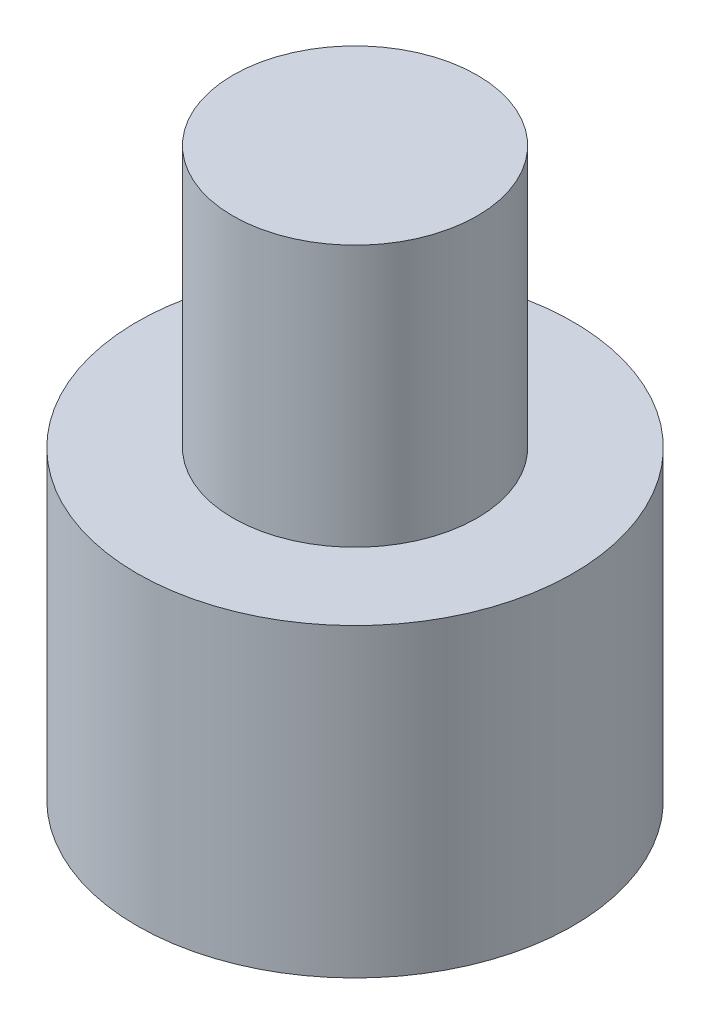
ISO-10303-21;
HEADER;
FILE_DESCRIPTION(('STEP AP214'),'2;1');
FILE_NAME('part.step','',(''),(''),'','','');
FILE_SCHEMA(('AUTOMOTIVE_DESIGN { 1 0 10303 214 1 1 1 1 }'));
ENDSEC;
DATA;
#1=APPLICATION_CONTEXT('core data for automotive mechanical design processes');
#2=APPLICATION_PROTOCOL_DEFINITION('international standard','automotive_design',2000,#1);
#3=PRODUCT_CONTEXT('',#1,'mechanical');
#4=PRODUCT('Part','Part','',(#3));
#5=PRODUCT_RELATED_PRODUCT_CATEGORY('part','',(#4));
#6=PRODUCT_DEFINITION_FORMATION('','',#4);
#7=PRODUCT_DEFINITION_CONTEXT('part definition',#1,'design');
#8=PRODUCT_DEFINITION('design','',#6,#7);
#9=PRODUCT_DEFINITION_SHAPE('','',#8);
#10=(LENGTH_UNIT() NAMED_UNIT(*) SI_UNIT(.MILLI.,.METRE.));
#11=(NAMED_UNIT(*) PLANE_ANGLE_UNIT() SI_UNIT($,.RADIAN.));
#12=(NAMED_UNIT(*) SI_UNIT($,.STERADIAN.) SOLID_ANGLE_UNIT());
#13=UNCERTAINTY_MEASURE_WITH_UNIT(LENGTH_MEASURE(1.E-05),#10,'distance_accuracy_value','');
#14=(GEOMETRIC_REPRESENTATION_CONTEXT(3) GLOBAL_UNCERTAINTY_ASSIGNED_CONTEXT((#13)) GLOBAL_UNIT_ASSIGNED_CONTEXT((#10,
#11,#12)) REPRESENTATION_CONTEXT('',''));
#15=CARTESIAN_POINT('',(0.,0.,0.));
#16=DIRECTION('',(0.,0.,1.));
#17=DIRECTION('',(1.,0.,0.));
#18=AXIS2_PLACEMENT_3D('',#15,#16,#17);
#19=CARTESIAN_POINT('',(0.,6.5,0.));
#20=DIRECTION('',(0.,-1.,0.));
#21=DIRECTION('',(0.,0.,-1.));
#22=AXIS2_PLACEMENT_3D('',#19,#20,#21);
#23=CYLINDRICAL_SURFACE('',#22,1.4);
#24=CARTESIAN_POINT('',(0.,3.5,0.));
#25=DIRECTION('',(0.,1.,0.));
#26=DIRECTION('',(0.,0.,1.));
#27=AXIS2_PLACEMENT_3D('',#24,#25,#26);
#28=CIRCLE('',#27,1.4);
#29=CARTESIAN_POINT('',(0.,3.5,1.4));
#30=VERTEX_POINT('',#29);
#31=EDGE_CURVE('E46',#30,#30,#28,.T.);
#32=ORIENTED_EDGE('',*,*,#31,.T.);
#33=EDGE_LOOP('',(#32));
#34=FACE_BOUND('',#33,.T.);
#35=CARTESIAN_POINT('',(0.,6.5,0.));
#36=DIRECTION('',(0.,1.,0.));
#37=DIRECTION('',(0.,0.,1.));
#38=AXIS2_PLACEMENT_3D('',#35,#36,#37);
#39=CIRCLE('',#38,1.4);
#40=CARTESIAN_POINT('',(0.,6.5,1.4));
#41=VERTEX_POINT('',#40);
#42=EDGE_CURVE('E10',#41,#41,#39,.T.);
#43=ORIENTED_EDGE('',*,*,#42,.F.);
#44=EDGE_LOOP('',(#43));
#45=FACE_BOUND('',#44,.T.);
#46=ADVANCED_FACE('F43',(#34,#45),#23,.T.);
#47=CARTESIAN_POINT('',(0.,6.5,0.));
#48=DIRECTION('',(0.,1.,0.));
#49=DIRECTION('',(0.,0.,1.));
#50=AXIS2_PLACEMENT_3D('',#47,#48,#49);
#51=PLANE('',#50);
#52=ORIENTED_EDGE('',*,*,#42,.T.);
#53=EDGE_LOOP('',(#52));
#54=FACE_BOUND('',#53,.T.);
#55=ADVANCED_FACE('F70',(#54),#51,.T.);
#56=CARTESIAN_POINT('',(0.,3.5,0.));
#57=DIRECTION('',(0.,-1.,0.));
#58=DIRECTION('',(0.,0.,-1.));
#59=AXIS2_PLACEMENT_3D('',#56,#57,#58);
#60=CYLINDRICAL_SURFACE('',#59,2.5);
#61=CARTESIAN_POINT('',(0.,3.5,0.));
#62=DIRECTION('',(0.,1.,0.));
#63=DIRECTION('',(0.,0.,1.));
#64=AXIS2_PLACEMENT_3D('',#61,#62,#63);
#65=CIRCLE('',#64,2.5);
#66=CARTESIAN_POINT('',(0.,3.5,2.5));
#67=VERTEX_POINT('',#66);
#68=EDGE_CURVE('E55',#67,#67,#65,.T.);
#69=ORIENTED_EDGE('',*,*,#68,.F.);
#70=EDGE_LOOP('',(#69));
#71=FACE_BOUND('',#70,.T.);
#72=CARTESIAN_POINT('',(0.,0.,0.));
#73=DIRECTION('',(0.,1.,0.));
#74=DIRECTION('',(0.,0.,1.));
#75=AXIS2_PLACEMENT_3D('',#72,#73,#74);
#76=CIRCLE('',#75,2.5);
#77=CARTESIAN_POINT('',(0.,0.,2.5));
#78=VERTEX_POINT('',#77);
#79=EDGE_CURVE('E57',#78,#78,#76,.T.);
#80=ORIENTED_EDGE('',*,*,#79,.T.);
#81=EDGE_LOOP('',(#80));
#82=FACE_BOUND('',#81,.T.);
#83=ADVANCED_FACE('F67',(#71,#82),#60,.T.);
#84=CARTESIAN_POINT('',(0.,3.5,0.));
#85=DIRECTION('',(0.,1.,0.));
#86=DIRECTION('',(0.,0.,1.));
#87=AXIS2_PLACEMENT_3D('',#84,#85,#86);
#88=PLANE('',#87);
#89=ORIENTED_EDGE('',*,*,#31,.F.);
#90=EDGE_LOOP('',(#89));
#91=FACE_BOUND('',#90,.T.);
#92=ORIENTED_EDGE('',*,*,#68,.T.);
#93=EDGE_LOOP('',(#92));
#94=FACE_BOUND('',#93,.T.);
#95=ADVANCED_FACE('F65',(#91,#94),#88,.T.);
#96=CARTESIAN_POINT('',(0.,0.,0.));
#97=DIRECTION('',(0.,1.,0.));
#98=DIRECTION('',(0.,0.,1.));
#99=AXIS2_PLACEMENT_3D('',#96,#97,#98);
#100=PLANE('',#99);
#101=ORIENTED_EDGE('',*,*,#79,.F.);
#102=EDGE_LOOP('',(#101));
#103=FACE_BOUND('',#102,.T.);
#104=ADVANCED_FACE('F74',(#103),#100,.F.);
#105=CLOSED_SHELL('',(#46,#55,#83,#95,#104));
#106=MANIFOLD_SOLID_BREP('B2',#105);
#107=ADVANCED_BREP_SHAPE_REPRESENTATION('',(#18,#106),#14);
#108=SHAPE_DEFINITION_REPRESENTATION(#9,#107);
ENDSEC;
END-ISO-10303-21;
